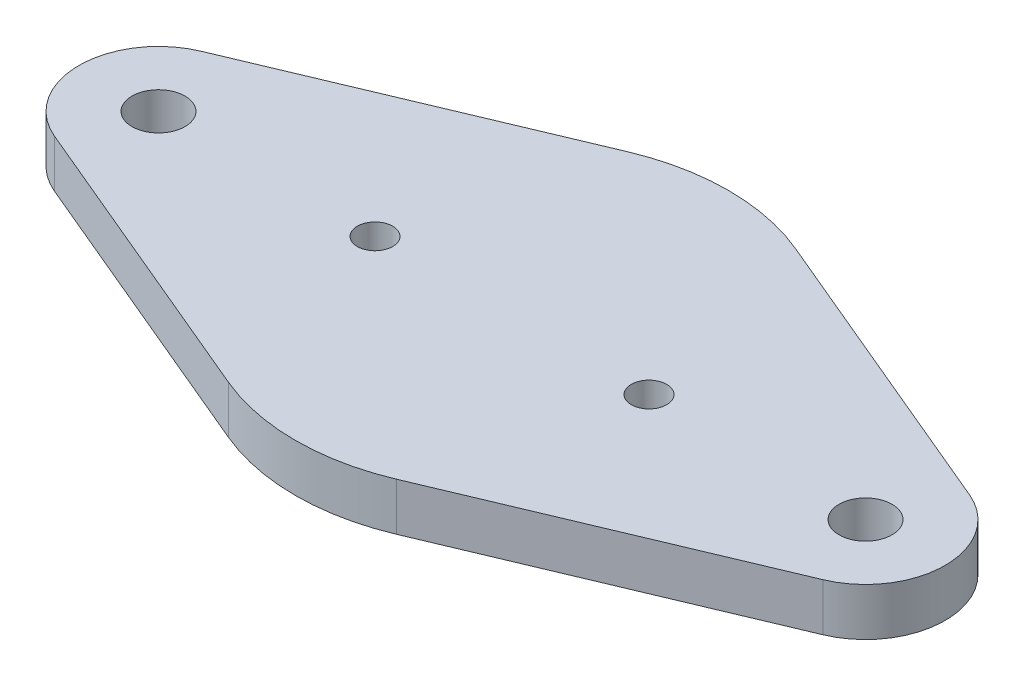
ISO-10303-21;
HEADER;
FILE_DESCRIPTION(('STEP AP214'),'2;1');
FILE_NAME('part.step','',(''),(''),'','','');
FILE_SCHEMA(('AUTOMOTIVE_DESIGN { 1 0 10303 214 1 1 1 1 }'));
ENDSEC;
DATA;
#1=APPLICATION_CONTEXT('core data for automotive mechanical design processes');
#2=APPLICATION_PROTOCOL_DEFINITION('international standard','automotive_design',2000,#1);
#3=PRODUCT_CONTEXT('',#1,'mechanical');
#4=PRODUCT('Part','Part','',(#3));
#5=PRODUCT_RELATED_PRODUCT_CATEGORY('part','',(#4));
#6=PRODUCT_DEFINITION_FORMATION('','',#4);
#7=PRODUCT_DEFINITION_CONTEXT('part definition',#1,'design');
#8=PRODUCT_DEFINITION('design','',#6,#7);
#9=PRODUCT_DEFINITION_SHAPE('','',#8);
#10=(LENGTH_UNIT() NAMED_UNIT(*) SI_UNIT(.MILLI.,.METRE.));
#11=(NAMED_UNIT(*) PLANE_ANGLE_UNIT() SI_UNIT($,.RADIAN.));
#12=(NAMED_UNIT(*) SI_UNIT($,.STERADIAN.) SOLID_ANGLE_UNIT());
#13=UNCERTAINTY_MEASURE_WITH_UNIT(LENGTH_MEASURE(1.E-05),#10,'distance_accuracy_value','');
#14=(GEOMETRIC_REPRESENTATION_CONTEXT(3) GLOBAL_UNCERTAINTY_ASSIGNED_CONTEXT((#13)) GLOBAL_UNIT_ASSIGNED_CONTEXT((#10,
#11,#12)) REPRESENTATION_CONTEXT('',''));
#15=CARTESIAN_POINT('',(0.,0.,0.));
#16=DIRECTION('',(0.,0.,1.));
#17=DIRECTION('',(1.,0.,0.));
#18=AXIS2_PLACEMENT_3D('',#15,#16,#17);
#19=CARTESIAN_POINT('',(0.,2.7,0.));
#20=DIRECTION('',(0.,-1.,0.));
#21=DIRECTION('',(0.,0.,-1.));
#22=AXIS2_PLACEMENT_3D('',#19,#20,#21);
#23=CYLINDRICAL_SURFACE('',#22,12.25);
#24=CARTESIAN_POINT('',(0.,0.,0.));
#25=DIRECTION('',(0.,1.,0.));
#26=DIRECTION('',(0.,0.,1.));
#27=AXIS2_PLACEMENT_3D('',#24,#25,#26);
#28=CIRCLE('',#27,12.25);
#29=CARTESIAN_POINT('',(4.746875,0.,-11.292903866339));
#30=VERTEX_POINT('',#29);
#31=CARTESIAN_POINT('',(-4.746875,0.,-11.292903866339));
#32=VERTEX_POINT('',#31);
#33=EDGE_CURVE('E130',#30,#32,#28,.T.);
#34=ORIENTED_EDGE('',*,*,#33,.T.);
#35=DIRECTION('',(0.,-1.,0.));
#36=VECTOR('',#35,1.);
#37=CARTESIAN_POINT('',(-4.746875,2.7,-11.292903866339));
#38=LINE('',#37,#36);
#39=CARTESIAN_POINT('',(-4.746875,2.7,-11.292903866339));
#40=VERTEX_POINT('',#39);
#41=EDGE_CURVE('E11',#40,#32,#38,.T.);
#42=ORIENTED_EDGE('',*,*,#41,.F.);
#43=CARTESIAN_POINT('',(0.,2.7,0.));
#44=DIRECTION('',(0.,1.,0.));
#45=DIRECTION('',(0.,0.,1.));
#46=AXIS2_PLACEMENT_3D('',#43,#44,#45);
#47=CIRCLE('',#46,12.25);
#48=CARTESIAN_POINT('',(4.746875,2.7,-11.292903866339));
#49=VERTEX_POINT('',#48);
#50=EDGE_CURVE('E145',#49,#40,#47,.T.);
#51=ORIENTED_EDGE('',*,*,#50,.F.);
#52=DIRECTION('',(0.,-1.,0.));
#53=VECTOR('',#52,1.);
#54=CARTESIAN_POINT('',(4.746875,2.7,-11.292903866339));
#55=LINE('',#54,#53);
#56=EDGE_CURVE('E126',#49,#30,#55,.T.);
#57=ORIENTED_EDGE('',*,*,#56,.T.);
#58=EDGE_LOOP('',(#34,#42,#51,#57));
#59=FACE_BOUND('',#58,.T.);
#60=ADVANCED_FACE('F34',(#59),#23,.T.);
#61=CARTESIAN_POINT('',(-4.746875,2.7,-11.292903866339));
#62=DIRECTION('',(0.3875,0.,0.921869703374615));
#63=DIRECTION('',(0.921869703374615,0.,-0.3875));
#64=AXIS2_PLACEMENT_3D('',#61,#62,#63);
#65=PLANE('',#64);
#66=DIRECTION('',(-0.921869703374615,0.,0.3875));
#67=VECTOR('',#66,1.);
#68=CARTESIAN_POINT('',(-4.746875,0.,-11.292903866339));
#69=LINE('',#68,#67);
#70=CARTESIAN_POINT('',(-21.74375,0.,-4.14841366518577));
#71=VERTEX_POINT('',#70);
#72=EDGE_CURVE('E133',#32,#71,#69,.T.);
#73=ORIENTED_EDGE('',*,*,#72,.T.);
#74=DIRECTION('',(0.,-1.,0.));
#75=VECTOR('',#74,1.);
#76=CARTESIAN_POINT('',(-21.74375,2.7,-4.14841366518577));
#77=LINE('',#76,#75);
#78=CARTESIAN_POINT('',(-21.74375,2.7,-4.14841366518577));
#79=VERTEX_POINT('',#78);
#80=EDGE_CURVE('E42',#79,#71,#77,.T.);
#81=ORIENTED_EDGE('',*,*,#80,.F.);
#82=DIRECTION('',(-0.921869703374615,0.,0.3875));
#83=VECTOR('',#82,1.);
#84=CARTESIAN_POINT('',(-4.746875,2.7,-11.292903866339));
#85=LINE('',#84,#83);
#86=EDGE_CURVE('E93',#40,#79,#85,.T.);
#87=ORIENTED_EDGE('',*,*,#86,.F.);
#88=ORIENTED_EDGE('',*,*,#41,.T.);
#89=EDGE_LOOP('',(#73,#81,#87,#88));
#90=FACE_BOUND('',#89,.T.);
#91=ADVANCED_FACE('F231',(#90),#65,.F.);
#92=CARTESIAN_POINT('',(-20.,2.7,0.));
#93=DIRECTION('',(0.,-1.,0.));
#94=DIRECTION('',(0.,0.,-1.));
#95=AXIS2_PLACEMENT_3D('',#92,#93,#94);
#96=CYLINDRICAL_SURFACE('',#95,4.5);
#97=CARTESIAN_POINT('',(-20.,0.,0.));
#98=DIRECTION('',(0.,1.,0.));
#99=DIRECTION('',(0.,0.,1.));
#100=AXIS2_PLACEMENT_3D('',#97,#98,#99);
#101=CIRCLE('',#100,4.5);
#102=CARTESIAN_POINT('',(-21.74375,0.,4.14841366518577));
#103=VERTEX_POINT('',#102);
#104=EDGE_CURVE('E136',#71,#103,#101,.T.);
#105=ORIENTED_EDGE('',*,*,#104,.T.);
#106=DIRECTION('',(0.,-1.,0.));
#107=VECTOR('',#106,1.);
#108=CARTESIAN_POINT('',(-21.74375,2.7,4.14841366518577));
#109=LINE('',#108,#107);
#110=CARTESIAN_POINT('',(-21.74375,2.7,4.14841366518577));
#111=VERTEX_POINT('',#110);
#112=EDGE_CURVE('E152',#111,#103,#109,.T.);
#113=ORIENTED_EDGE('',*,*,#112,.F.);
#114=CARTESIAN_POINT('',(-20.,2.7,0.));
#115=DIRECTION('',(0.,1.,0.));
#116=DIRECTION('',(0.,0.,1.));
#117=AXIS2_PLACEMENT_3D('',#114,#115,#116);
#118=CIRCLE('',#117,4.5);
#119=EDGE_CURVE('E160',#79,#111,#118,.T.);
#120=ORIENTED_EDGE('',*,*,#119,.F.);
#121=ORIENTED_EDGE('',*,*,#80,.T.);
#122=EDGE_LOOP('',(#105,#113,#120,#121));
#123=FACE_BOUND('',#122,.T.);
#124=ADVANCED_FACE('F158',(#123),#96,.T.);
#125=CARTESIAN_POINT('',(-21.74375,2.7,4.14841366518577));
#126=DIRECTION('',(0.3875,0.,-0.921869703374615));
#127=DIRECTION('',(-0.921869703374615,0.,-0.3875));
#128=AXIS2_PLACEMENT_3D('',#125,#126,#127);
#129=PLANE('',#128);
#130=DIRECTION('',(0.921869703374615,0.,0.3875));
#131=VECTOR('',#130,1.);
#132=CARTESIAN_POINT('',(-21.74375,0.,4.14841366518577));
#133=LINE('',#132,#131);
#134=CARTESIAN_POINT('',(-4.746875,0.,11.292903866339));
#135=VERTEX_POINT('',#134);
#136=EDGE_CURVE('E138',#103,#135,#133,.T.);
#137=ORIENTED_EDGE('',*,*,#136,.T.);
#138=DIRECTION('',(0.,-1.,0.));
#139=VECTOR('',#138,1.);
#140=CARTESIAN_POINT('',(-4.746875,2.7,11.292903866339));
#141=LINE('',#140,#139);
#142=CARTESIAN_POINT('',(-4.746875,2.7,11.292903866339));
#143=VERTEX_POINT('',#142);
#144=EDGE_CURVE('E149',#143,#135,#141,.T.);
#145=ORIENTED_EDGE('',*,*,#144,.F.);
#146=DIRECTION('',(0.921869703374615,0.,0.3875));
#147=VECTOR('',#146,1.);
#148=CARTESIAN_POINT('',(-21.74375,2.7,4.14841366518577));
#149=LINE('',#148,#147);
#150=EDGE_CURVE('E172',#111,#143,#149,.T.);
#151=ORIENTED_EDGE('',*,*,#150,.F.);
#152=ORIENTED_EDGE('',*,*,#112,.T.);
#153=EDGE_LOOP('',(#137,#145,#151,#152));
#154=FACE_BOUND('',#153,.T.);
#155=ADVANCED_FACE('F168',(#154),#129,.F.);
#156=CARTESIAN_POINT('',(0.,2.7,0.));
#157=DIRECTION('',(0.,-1.,0.));
#158=DIRECTION('',(0.,0.,-1.));
#159=AXIS2_PLACEMENT_3D('',#156,#157,#158);
#160=CYLINDRICAL_SURFACE('',#159,12.25);
#161=CARTESIAN_POINT('',(0.,0.,0.));
#162=DIRECTION('',(0.,1.,0.));
#163=DIRECTION('',(0.,0.,1.));
#164=AXIS2_PLACEMENT_3D('',#161,#162,#163);
#165=CIRCLE('',#164,12.25);
#166=CARTESIAN_POINT('',(4.746875,0.,11.292903866339));
#167=VERTEX_POINT('',#166);
#168=EDGE_CURVE('E140',#135,#167,#165,.T.);
#169=ORIENTED_EDGE('',*,*,#168,.T.);
#170=DIRECTION('',(0.,-1.,0.));
#171=VECTOR('',#170,1.);
#172=CARTESIAN_POINT('',(4.746875,2.7,11.292903866339));
#173=LINE('',#172,#171);
#174=CARTESIAN_POINT('',(4.746875,2.7,11.292903866339));
#175=VERTEX_POINT('',#174);
#176=EDGE_CURVE('E121',#175,#167,#173,.T.);
#177=ORIENTED_EDGE('',*,*,#176,.F.);
#178=CARTESIAN_POINT('',(0.,2.7,0.));
#179=DIRECTION('',(0.,1.,0.));
#180=DIRECTION('',(0.,0.,1.));
#181=AXIS2_PLACEMENT_3D('',#178,#179,#180);
#182=CIRCLE('',#181,12.25);
#183=EDGE_CURVE('E112',#143,#175,#182,.T.);
#184=ORIENTED_EDGE('',*,*,#183,.F.);
#185=ORIENTED_EDGE('',*,*,#144,.T.);
#186=EDGE_LOOP('',(#169,#177,#184,#185));
#187=FACE_BOUND('',#186,.T.);
#188=ADVANCED_FACE('F171',(#187),#160,.T.);
#189=CARTESIAN_POINT('',(21.74375,2.7,4.14841366518576));
#190=DIRECTION('',(-0.3875,0.,-0.921869703374615));
#191=DIRECTION('',(-0.921869703374615,0.,0.3875));
#192=AXIS2_PLACEMENT_3D('',#189,#190,#191);
#193=PLANE('',#192);
#194=DIRECTION('',(0.921869703374615,0.,-0.3875));
#195=VECTOR('',#194,1.);
#196=CARTESIAN_POINT('',(21.74375,0.,4.14841366518576));
#197=LINE('',#196,#195);
#198=CARTESIAN_POINT('',(21.74375,0.,4.14841366518577));
#199=VERTEX_POINT('',#198);
#200=EDGE_CURVE('E120',#167,#199,#197,.T.);
#201=ORIENTED_EDGE('',*,*,#200,.T.);
#202=DIRECTION('',(0.,-1.,0.));
#203=VECTOR('',#202,1.);
#204=CARTESIAN_POINT('',(21.74375,2.7,4.14841366518577));
#205=LINE('',#204,#203);
#206=CARTESIAN_POINT('',(21.74375,2.7,4.14841366518577));
#207=VERTEX_POINT('',#206);
#208=EDGE_CURVE('E117',#207,#199,#205,.T.);
#209=ORIENTED_EDGE('',*,*,#208,.F.);
#210=DIRECTION('',(0.921869703374615,0.,-0.3875));
#211=VECTOR('',#210,1.);
#212=CARTESIAN_POINT('',(21.74375,2.7,4.14841366518576));
#213=LINE('',#212,#211);
#214=EDGE_CURVE('E106',#175,#207,#213,.T.);
#215=ORIENTED_EDGE('',*,*,#214,.F.);
#216=ORIENTED_EDGE('',*,*,#176,.T.);
#217=EDGE_LOOP('',(#201,#209,#215,#216));
#218=FACE_BOUND('',#217,.T.);
#219=ADVANCED_FACE('F118',(#218),#193,.F.);
#220=CARTESIAN_POINT('',(20.,2.7,0.));
#221=DIRECTION('',(0.,-1.,0.));
#222=DIRECTION('',(0.,0.,-1.));
#223=AXIS2_PLACEMENT_3D('',#220,#221,#222);
#224=CYLINDRICAL_SURFACE('',#223,4.5);
#225=CARTESIAN_POINT('',(20.,0.,0.));
#226=DIRECTION('',(0.,1.,0.));
#227=DIRECTION('',(0.,0.,1.));
#228=AXIS2_PLACEMENT_3D('',#225,#226,#227);
#229=CIRCLE('',#228,4.5);
#230=CARTESIAN_POINT('',(21.74375,0.,-4.14841366518577));
#231=VERTEX_POINT('',#230);
#232=EDGE_CURVE('E79',#199,#231,#229,.T.);
#233=ORIENTED_EDGE('',*,*,#232,.T.);
#234=DIRECTION('',(0.,-1.,0.));
#235=VECTOR('',#234,1.);
#236=CARTESIAN_POINT('',(21.74375,2.7,-4.14841366518577));
#237=LINE('',#236,#235);
#238=CARTESIAN_POINT('',(21.74375,2.7,-4.14841366518577));
#239=VERTEX_POINT('',#238);
#240=EDGE_CURVE('E122',#239,#231,#237,.T.);
#241=ORIENTED_EDGE('',*,*,#240,.F.);
#242=CARTESIAN_POINT('',(20.,2.7,0.));
#243=DIRECTION('',(0.,1.,0.));
#244=DIRECTION('',(0.,0.,1.));
#245=AXIS2_PLACEMENT_3D('',#242,#243,#244);
#246=CIRCLE('',#245,4.5);
#247=EDGE_CURVE('E110',#207,#239,#246,.T.);
#248=ORIENTED_EDGE('',*,*,#247,.F.);
#249=ORIENTED_EDGE('',*,*,#208,.T.);
#250=EDGE_LOOP('',(#233,#241,#248,#249));
#251=FACE_BOUND('',#250,.T.);
#252=ADVANCED_FACE('F124',(#251),#224,.T.);
#253=CARTESIAN_POINT('',(4.746875,2.7,-11.292903866339));
#254=DIRECTION('',(-0.3875,0.,0.921869703374615));
#255=DIRECTION('',(0.921869703374615,0.,0.3875));
#256=AXIS2_PLACEMENT_3D('',#253,#254,#255);
#257=PLANE('',#256);
#258=DIRECTION('',(-0.921869703374615,0.,-0.3875));
#259=VECTOR('',#258,1.);
#260=CARTESIAN_POINT('',(4.746875,0.,-11.292903866339));
#261=LINE('',#260,#259);
#262=EDGE_CURVE('E85',#231,#30,#261,.T.);
#263=ORIENTED_EDGE('',*,*,#262,.T.);
#264=ORIENTED_EDGE('',*,*,#56,.F.);
#265=DIRECTION('',(-0.921869703374615,0.,-0.3875));
#266=VECTOR('',#265,1.);
#267=CARTESIAN_POINT('',(4.746875,2.7,-11.292903866339));
#268=LINE('',#267,#266);
#269=EDGE_CURVE('E50',#239,#49,#268,.T.);
#270=ORIENTED_EDGE('',*,*,#269,.F.);
#271=ORIENTED_EDGE('',*,*,#240,.T.);
#272=EDGE_LOOP('',(#263,#264,#270,#271));
#273=FACE_BOUND('',#272,.T.);
#274=ADVANCED_FACE('F207',(#273),#257,.F.);
#275=CARTESIAN_POINT('',(0.,2.7,0.));
#276=DIRECTION('',(0.,1.,0.));
#277=DIRECTION('',(0.,0.,1.));
#278=AXIS2_PLACEMENT_3D('',#275,#276,#277);
#279=PLANE('',#278);
#280=CARTESIAN_POINT('',(-7.75,2.7,0.));
#281=DIRECTION('',(0.,1.,0.));
#282=DIRECTION('',(0.,0.,1.));
#283=AXIS2_PLACEMENT_3D('',#280,#281,#282);
#284=CIRCLE('',#283,1.);
#285=CARTESIAN_POINT('',(-7.75,2.7,1.));
#286=VERTEX_POINT('',#285);
#287=EDGE_CURVE('E198',#286,#286,#284,.T.);
#288=ORIENTED_EDGE('',*,*,#287,.F.);
#289=EDGE_LOOP('',(#288));
#290=FACE_BOUND('',#289,.T.);
#291=CARTESIAN_POINT('',(7.75,2.7,0.));
#292=DIRECTION('',(0.,1.,0.));
#293=DIRECTION('',(0.,0.,1.));
#294=AXIS2_PLACEMENT_3D('',#291,#292,#293);
#295=CIRCLE('',#294,1.);
#296=CARTESIAN_POINT('',(7.75,2.7,1.));
#297=VERTEX_POINT('',#296);
#298=EDGE_CURVE('E192',#297,#297,#295,.T.);
#299=ORIENTED_EDGE('',*,*,#298,.F.);
#300=EDGE_LOOP('',(#299));
#301=FACE_BOUND('',#300,.T.);
#302=CARTESIAN_POINT('',(20.,2.7,0.));
#303=DIRECTION('',(0.,1.,0.));
#304=DIRECTION('',(0.,0.,1.));
#305=AXIS2_PLACEMENT_3D('',#302,#303,#304);
#306=CIRCLE('',#305,1.5);
#307=CARTESIAN_POINT('',(20.,2.7,1.5));
#308=VERTEX_POINT('',#307);
#309=EDGE_CURVE('E186',#308,#308,#306,.T.);
#310=ORIENTED_EDGE('',*,*,#309,.F.);
#311=EDGE_LOOP('',(#310));
#312=FACE_BOUND('',#311,.T.);
#313=CARTESIAN_POINT('',(-20.,2.7,0.));
#314=DIRECTION('',(0.,1.,0.));
#315=DIRECTION('',(0.,0.,1.));
#316=AXIS2_PLACEMENT_3D('',#313,#314,#315);
#317=CIRCLE('',#316,1.5);
#318=CARTESIAN_POINT('',(-20.,2.7,1.5));
#319=VERTEX_POINT('',#318);
#320=EDGE_CURVE('E180',#319,#319,#317,.T.);
#321=ORIENTED_EDGE('',*,*,#320,.F.);
#322=EDGE_LOOP('',(#321));
#323=FACE_BOUND('',#322,.T.);
#324=ORIENTED_EDGE('',*,*,#50,.T.);
#325=ORIENTED_EDGE('',*,*,#86,.T.);
#326=ORIENTED_EDGE('',*,*,#119,.T.);
#327=ORIENTED_EDGE('',*,*,#150,.T.);
#328=ORIENTED_EDGE('',*,*,#183,.T.);
#329=ORIENTED_EDGE('',*,*,#214,.T.);
#330=ORIENTED_EDGE('',*,*,#247,.T.);
#331=ORIENTED_EDGE('',*,*,#269,.T.);
#332=EDGE_LOOP('',(#324,#325,#326,#327,#328,#329,#330,#331));
#333=FACE_BOUND('',#332,.T.);
#334=ADVANCED_FACE('F108',(#290,#301,#312,#323,#333),#279,.T.);
#335=CARTESIAN_POINT('',(0.,0.,0.));
#336=DIRECTION('',(0.,1.,0.));
#337=DIRECTION('',(0.,0.,1.));
#338=AXIS2_PLACEMENT_3D('',#335,#336,#337);
#339=PLANE('',#338);
#340=CARTESIAN_POINT('',(-7.75,0.,0.));
#341=DIRECTION('',(0.,1.,0.));
#342=DIRECTION('',(0.,0.,1.));
#343=AXIS2_PLACEMENT_3D('',#340,#341,#342);
#344=CIRCLE('',#343,1.);
#345=CARTESIAN_POINT('',(-7.75,0.,1.));
#346=VERTEX_POINT('',#345);
#347=EDGE_CURVE('E195',#346,#346,#344,.F.);
#348=ORIENTED_EDGE('',*,*,#347,.F.);
#349=EDGE_LOOP('',(#348));
#350=FACE_BOUND('',#349,.T.);
#351=CARTESIAN_POINT('',(7.75,0.,0.));
#352=DIRECTION('',(0.,1.,0.));
#353=DIRECTION('',(0.,0.,1.));
#354=AXIS2_PLACEMENT_3D('',#351,#352,#353);
#355=CIRCLE('',#354,1.);
#356=CARTESIAN_POINT('',(7.75,0.,1.));
#357=VERTEX_POINT('',#356);
#358=EDGE_CURVE('E189',#357,#357,#355,.F.);
#359=ORIENTED_EDGE('',*,*,#358,.F.);
#360=EDGE_LOOP('',(#359));
#361=FACE_BOUND('',#360,.T.);
#362=CARTESIAN_POINT('',(20.,0.,0.));
#363=DIRECTION('',(0.,1.,0.));
#364=DIRECTION('',(0.,0.,1.));
#365=AXIS2_PLACEMENT_3D('',#362,#363,#364);
#366=CIRCLE('',#365,1.5);
#367=CARTESIAN_POINT('',(20.,0.,1.5));
#368=VERTEX_POINT('',#367);
#369=EDGE_CURVE('E183',#368,#368,#366,.F.);
#370=ORIENTED_EDGE('',*,*,#369,.F.);
#371=EDGE_LOOP('',(#370));
#372=FACE_BOUND('',#371,.T.);
#373=CARTESIAN_POINT('',(-20.,0.,0.));
#374=DIRECTION('',(0.,1.,0.));
#375=DIRECTION('',(0.,0.,1.));
#376=AXIS2_PLACEMENT_3D('',#373,#374,#375);
#377=CIRCLE('',#376,1.5);
#378=CARTESIAN_POINT('',(-20.,0.,1.5));
#379=VERTEX_POINT('',#378);
#380=EDGE_CURVE('E134',#379,#379,#377,.F.);
#381=ORIENTED_EDGE('',*,*,#380,.F.);
#382=EDGE_LOOP('',(#381));
#383=FACE_BOUND('',#382,.T.);
#384=ORIENTED_EDGE('',*,*,#33,.F.);
#385=ORIENTED_EDGE('',*,*,#262,.F.);
#386=ORIENTED_EDGE('',*,*,#232,.F.);
#387=ORIENTED_EDGE('',*,*,#200,.F.);
#388=ORIENTED_EDGE('',*,*,#168,.F.);
#389=ORIENTED_EDGE('',*,*,#136,.F.);
#390=ORIENTED_EDGE('',*,*,#104,.F.);
#391=ORIENTED_EDGE('',*,*,#72,.F.);
#392=EDGE_LOOP('',(#384,#385,#386,#387,#388,#389,#390,#391));
#393=FACE_BOUND('',#392,.T.);
#394=ADVANCED_FACE('F164',(#350,#361,#372,#383,#393),#339,.F.);
#395=CARTESIAN_POINT('',(-20.,-0.00100000000000013,0.));
#396=DIRECTION('',(0.,1.,0.));
#397=DIRECTION('',(0.,0.,1.));
#398=AXIS2_PLACEMENT_3D('',#395,#396,#397);
#399=CYLINDRICAL_SURFACE('',#398,1.5);
#400=ORIENTED_EDGE('',*,*,#320,.T.);
#401=EDGE_LOOP('',(#400));
#402=FACE_BOUND('',#401,.T.);
#403=ORIENTED_EDGE('',*,*,#380,.T.);
#404=EDGE_LOOP('',(#403));
#405=FACE_BOUND('',#404,.T.);
#406=ADVANCED_FACE('F215',(#402,#405),#399,.F.);
#407=CARTESIAN_POINT('',(20.,-0.00100000000000013,0.));
#408=DIRECTION('',(0.,1.,0.));
#409=DIRECTION('',(0.,0.,1.));
#410=AXIS2_PLACEMENT_3D('',#407,#408,#409);
#411=CYLINDRICAL_SURFACE('',#410,1.5);
#412=ORIENTED_EDGE('',*,*,#309,.T.);
#413=EDGE_LOOP('',(#412));
#414=FACE_BOUND('',#413,.T.);
#415=ORIENTED_EDGE('',*,*,#369,.T.);
#416=EDGE_LOOP('',(#415));
#417=FACE_BOUND('',#416,.T.);
#418=ADVANCED_FACE('F218',(#414,#417),#411,.F.);
#419=CARTESIAN_POINT('',(7.75,-0.00100000000000013,0.));
#420=DIRECTION('',(0.,1.,0.));
#421=DIRECTION('',(0.,0.,1.));
#422=AXIS2_PLACEMENT_3D('',#419,#420,#421);
#423=CYLINDRICAL_SURFACE('',#422,1.);
#424=ORIENTED_EDGE('',*,*,#298,.T.);
#425=EDGE_LOOP('',(#424));
#426=FACE_BOUND('',#425,.T.);
#427=ORIENTED_EDGE('',*,*,#358,.T.);
#428=EDGE_LOOP('',(#427));
#429=FACE_BOUND('',#428,.T.);
#430=ADVANCED_FACE('F300',(#426,#429),#423,.F.);
#431=CARTESIAN_POINT('',(-7.75,-0.00100000000000013,0.));
#432=DIRECTION('',(0.,1.,0.));
#433=DIRECTION('',(0.,0.,1.));
#434=AXIS2_PLACEMENT_3D('',#431,#432,#433);
#435=CYLINDRICAL_SURFACE('',#434,1.);
#436=ORIENTED_EDGE('',*,*,#287,.T.);
#437=EDGE_LOOP('',(#436));
#438=FACE_BOUND('',#437,.T.);
#439=ORIENTED_EDGE('',*,*,#347,.T.);
#440=EDGE_LOOP('',(#439));
#441=FACE_BOUND('',#440,.T.);
#442=ADVANCED_FACE('F202',(#438,#441),#435,.F.);
#443=CLOSED_SHELL('',(#60,#91,#124,#155,#188,#219,#252,#274,#334,#394,#406,#418,#430,#442));
#444=MANIFOLD_SOLID_BREP('B2',#443);
#445=ADVANCED_BREP_SHAPE_REPRESENTATION('',(#18,#444),#14);
#446=SHAPE_DEFINITION_REPRESENTATION(#9,#445);
ENDSEC;
END-ISO-10303-21;
